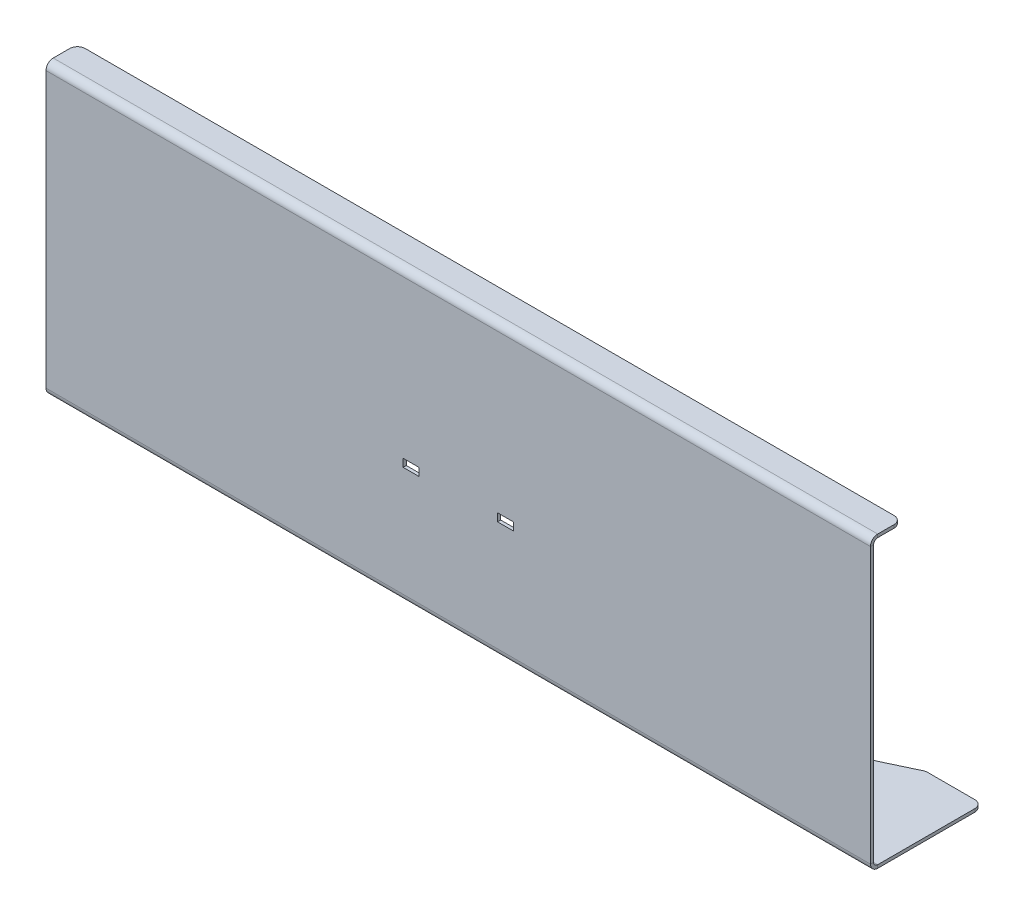
ISO-10303-21;
HEADER;
FILE_DESCRIPTION(('STEP AP214'),'2;1');
FILE_NAME('part.step','',(''),(''),'','','');
FILE_SCHEMA(('AUTOMOTIVE_DESIGN { 1 0 10303 214 1 1 1 1 }'));
ENDSEC;
DATA;
#1=APPLICATION_CONTEXT('core data for automotive mechanical design processes');
#2=APPLICATION_PROTOCOL_DEFINITION('international standard','automotive_design',2000,#1);
#3=PRODUCT_CONTEXT('',#1,'mechanical');
#4=PRODUCT('Part','Part','',(#3));
#5=PRODUCT_RELATED_PRODUCT_CATEGORY('part','',(#4));
#6=PRODUCT_DEFINITION_FORMATION('','',#4);
#7=PRODUCT_DEFINITION_CONTEXT('part definition',#1,'design');
#8=PRODUCT_DEFINITION('design','',#6,#7);
#9=PRODUCT_DEFINITION_SHAPE('','',#8);
#10=(LENGTH_UNIT() NAMED_UNIT(*) SI_UNIT(.MILLI.,.METRE.));
#11=(NAMED_UNIT(*) PLANE_ANGLE_UNIT() SI_UNIT($,.RADIAN.));
#12=(NAMED_UNIT(*) SI_UNIT($,.STERADIAN.) SOLID_ANGLE_UNIT());
#13=UNCERTAINTY_MEASURE_WITH_UNIT(LENGTH_MEASURE(1.E-05),#10,'distance_accuracy_value','');
#14=(GEOMETRIC_REPRESENTATION_CONTEXT(3) GLOBAL_UNCERTAINTY_ASSIGNED_CONTEXT((#13)) GLOBAL_UNIT_ASSIGNED_CONTEXT((#10,
#11,#12)) REPRESENTATION_CONTEXT('',''));
#15=CARTESIAN_POINT('',(0.,0.,0.));
#16=DIRECTION('',(0.,0.,1.));
#17=DIRECTION('',(1.,0.,0.));
#18=AXIS2_PLACEMENT_3D('',#15,#16,#17);
#19=CARTESIAN_POINT('',(-262.,4.6,-2.));
#20=DIRECTION('',(-1.,0.,0.));
#21=DIRECTION('',(0.,0.,1.));
#22=AXIS2_PLACEMENT_3D('',#19,#20,#21);
#23=PLANE('',#22);
#24=DIRECTION('',(0.,0.,-1.));
#25=VECTOR('',#24,1.);
#26=CARTESIAN_POINT('',(-262.,2.,0.));
#27=LINE('',#26,#25);
#28=CARTESIAN_POINT('',(-262.,2.,-4.6));
#29=VERTEX_POINT('',#28);
#30=CARTESIAN_POINT('',(-262.,2.,-66.2813416123875));
#31=VERTEX_POINT('',#30);
#32=EDGE_CURVE('E335',#29,#31,#27,.T.);
#33=ORIENTED_EDGE('',*,*,#32,.T.);
#34=DIRECTION('',(0.,-1.,0.));
#35=VECTOR('',#34,1.);
#36=CARTESIAN_POINT('',(-262.,4.6,-66.2813416123875));
#37=LINE('',#36,#35);
#38=CARTESIAN_POINT('',(-262.,0.,-66.2813416123875));
#39=VERTEX_POINT('',#38);
#40=EDGE_CURVE('E424',#31,#39,#37,.T.);
#41=ORIENTED_EDGE('',*,*,#40,.T.);
#42=DIRECTION('',(0.,0.,-1.));
#43=VECTOR('',#42,1.);
#44=CARTESIAN_POINT('',(-262.,0.,0.));
#45=LINE('',#44,#43);
#46=CARTESIAN_POINT('',(-262.,0.,-4.6));
#47=VERTEX_POINT('',#46);
#48=EDGE_CURVE('E295',#47,#39,#45,.T.);
#49=ORIENTED_EDGE('',*,*,#48,.F.);
#50=DIRECTION('',(0.,1.,0.));
#51=VECTOR('',#50,1.);
#52=CARTESIAN_POINT('',(-262.,0.,-4.6));
#53=LINE('',#52,#51);
#54=EDGE_CURVE('E400',#47,#29,#53,.T.);
#55=ORIENTED_EDGE('',*,*,#54,.T.);
#56=EDGE_LOOP('',(#33,#41,#49,#55));
#57=FACE_BOUND('',#56,.T.);
#58=ADVANCED_FACE('F36',(#57),#23,.T.);
#59=CARTESIAN_POINT('',(262.,4.6,-4.6));
#60=DIRECTION('',(1.,0.,0.));
#61=DIRECTION('',(0.,0.,-1.));
#62=AXIS2_PLACEMENT_3D('',#59,#60,#61);
#63=PLANE('',#62);
#64=DIRECTION('',(0.,0.,-1.));
#65=VECTOR('',#64,1.);
#66=CARTESIAN_POINT('',(262.,0.,0.));
#67=LINE('',#66,#65);
#68=CARTESIAN_POINT('',(262.,0.,-4.6));
#69=VERTEX_POINT('',#68);
#70=CARTESIAN_POINT('',(262.,0.,-66.2813416123875));
#71=VERTEX_POINT('',#70);
#72=EDGE_CURVE('E303',#69,#71,#67,.T.);
#73=ORIENTED_EDGE('',*,*,#72,.T.);
#74=DIRECTION('',(0.,-1.,0.));
#75=VECTOR('',#74,1.);
#76=CARTESIAN_POINT('',(262.,4.6,-66.2813416123875));
#77=LINE('',#76,#75);
#78=CARTESIAN_POINT('',(262.,2.,-66.2813416123875));
#79=VERTEX_POINT('',#78);
#80=EDGE_CURVE('E11',#71,#79,#77,.F.);
#81=ORIENTED_EDGE('',*,*,#80,.T.);
#82=DIRECTION('',(0.,0.,-1.));
#83=VECTOR('',#82,1.);
#84=CARTESIAN_POINT('',(262.,2.,0.));
#85=LINE('',#84,#83);
#86=CARTESIAN_POINT('',(262.,2.,-4.6));
#87=VERTEX_POINT('',#86);
#88=EDGE_CURVE('E306',#87,#79,#85,.T.);
#89=ORIENTED_EDGE('',*,*,#88,.F.);
#90=DIRECTION('',(0.,-1.,0.));
#91=VECTOR('',#90,1.);
#92=CARTESIAN_POINT('',(262.,2.,-4.6));
#93=LINE('',#92,#91);
#94=EDGE_CURVE('E402',#87,#69,#93,.T.);
#95=ORIENTED_EDGE('',*,*,#94,.T.);
#96=EDGE_LOOP('',(#73,#81,#89,#95));
#97=FACE_BOUND('',#96,.T.);
#98=ADVANCED_FACE('F508',(#97),#63,.T.);
#99=CARTESIAN_POINT('',(262.,4.6,0.));
#100=DIRECTION('',(1.,0.,0.));
#101=DIRECTION('',(0.,0.,-1.));
#102=AXIS2_PLACEMENT_3D('',#99,#100,#101);
#103=PLANE('',#102);
#104=DIRECTION('',(0.,0.,-1.));
#105=VECTOR('',#104,1.);
#106=CARTESIAN_POINT('',(262.,4.6,0.));
#107=LINE('',#106,#105);
#108=CARTESIAN_POINT('',(262.,4.6,0.));
#109=VERTEX_POINT('',#108);
#110=CARTESIAN_POINT('',(262.,4.6,-2.));
#111=VERTEX_POINT('',#110);
#112=EDGE_CURVE('E404',#109,#111,#107,.T.);
#113=ORIENTED_EDGE('',*,*,#112,.F.);
#114=CARTESIAN_POINT('',(262.,4.6,-4.6));
#115=DIRECTION('',(1.,0.,0.));
#116=DIRECTION('',(0.,0.,-1.));
#117=AXIS2_PLACEMENT_3D('',#114,#115,#116);
#118=CIRCLE('',#117,4.6);
#119=EDGE_CURVE('E329',#109,#69,#118,.T.);
#120=ORIENTED_EDGE('',*,*,#119,.T.);
#121=ORIENTED_EDGE('',*,*,#94,.F.);
#122=CARTESIAN_POINT('',(262.,4.6,-4.6));
#123=DIRECTION('',(1.,0.,0.));
#124=DIRECTION('',(0.,0.,-1.));
#125=AXIS2_PLACEMENT_3D('',#122,#123,#124);
#126=CIRCLE('',#125,2.6);
#127=EDGE_CURVE('E310',#111,#87,#126,.T.);
#128=ORIENTED_EDGE('',*,*,#127,.F.);
#129=EDGE_LOOP('',(#113,#120,#121,#128));
#130=FACE_BOUND('',#129,.T.);
#131=ADVANCED_FACE('F525',(#130),#103,.T.);
#132=CARTESIAN_POINT('',(262.,2.,-4.6));
#133=DIRECTION('',(1.,0.,0.));
#134=DIRECTION('',(0.,0.,-1.));
#135=AXIS2_PLACEMENT_3D('',#132,#133,#134);
#136=PLANE('',#135);
#137=DIRECTION('',(0.,-1.,0.));
#138=VECTOR('',#137,1.);
#139=CARTESIAN_POINT('',(262.,0.,0.));
#140=LINE('',#139,#138);
#141=CARTESIAN_POINT('',(262.,179.4,0.));
#142=VERTEX_POINT('',#141);
#143=EDGE_CURVE('E326',#142,#109,#140,.T.);
#144=ORIENTED_EDGE('',*,*,#143,.T.);
#145=ORIENTED_EDGE('',*,*,#112,.T.);
#146=DIRECTION('',(0.,1.,0.));
#147=VECTOR('',#146,1.);
#148=CARTESIAN_POINT('',(262.,0.,-2.));
#149=LINE('',#148,#147);
#150=CARTESIAN_POINT('',(262.,179.4,-2.));
#151=VERTEX_POINT('',#150);
#152=EDGE_CURVE('E313',#151,#111,#149,.F.);
#153=ORIENTED_EDGE('',*,*,#152,.F.);
#154=DIRECTION('',(0.,0.,1.));
#155=VECTOR('',#154,1.);
#156=CARTESIAN_POINT('',(262.,179.4,-2.));
#157=LINE('',#156,#155);
#158=EDGE_CURVE('E393',#151,#142,#157,.T.);
#159=ORIENTED_EDGE('',*,*,#158,.T.);
#160=EDGE_LOOP('',(#144,#145,#153,#159));
#161=FACE_BOUND('',#160,.T.);
#162=ADVANCED_FACE('F533',(#161),#136,.T.);
#163=CARTESIAN_POINT('',(-262.,0.,-4.6));
#164=DIRECTION('',(-1.,0.,0.));
#165=DIRECTION('',(0.,0.,1.));
#166=AXIS2_PLACEMENT_3D('',#163,#164,#165);
#167=PLANE('',#166);
#168=ORIENTED_EDGE('',*,*,#54,.F.);
#169=CARTESIAN_POINT('',(-262.,4.6,-4.6));
#170=DIRECTION('',(1.,0.,0.));
#171=DIRECTION('',(0.,0.,-1.));
#172=AXIS2_PLACEMENT_3D('',#169,#170,#171);
#173=CIRCLE('',#172,4.6);
#174=CARTESIAN_POINT('',(-262.,4.6,0.));
#175=VERTEX_POINT('',#174);
#176=EDGE_CURVE('E307',#175,#47,#173,.T.);
#177=ORIENTED_EDGE('',*,*,#176,.F.);
#178=DIRECTION('',(0.,0.,1.));
#179=VECTOR('',#178,1.);
#180=CARTESIAN_POINT('',(-262.,4.6,-2.));
#181=LINE('',#180,#179);
#182=CARTESIAN_POINT('',(-262.,4.6,-2.));
#183=VERTEX_POINT('',#182);
#184=EDGE_CURVE('E398',#183,#175,#181,.T.);
#185=ORIENTED_EDGE('',*,*,#184,.F.);
#186=CARTESIAN_POINT('',(-262.,4.6,-4.6));
#187=DIRECTION('',(1.,0.,0.));
#188=DIRECTION('',(0.,0.,-1.));
#189=AXIS2_PLACEMENT_3D('',#186,#187,#188);
#190=CIRCLE('',#189,2.6);
#191=EDGE_CURVE('E338',#183,#29,#190,.T.);
#192=ORIENTED_EDGE('',*,*,#191,.T.);
#193=EDGE_LOOP('',(#168,#177,#185,#192));
#194=FACE_BOUND('',#193,.T.);
#195=ADVANCED_FACE('F499',(#194),#167,.T.);
#196=CARTESIAN_POINT('',(262.,184.,-4.6));
#197=DIRECTION('',(1.,0.,0.));
#198=DIRECTION('',(0.,0.,-1.));
#199=AXIS2_PLACEMENT_3D('',#196,#197,#198);
#200=PLANE('',#199);
#201=DIRECTION('',(0.,-1.,0.));
#202=VECTOR('',#201,1.);
#203=CARTESIAN_POINT('',(262.,184.,-4.6));
#204=LINE('',#203,#202);
#205=CARTESIAN_POINT('',(262.,184.,-4.6));
#206=VERTEX_POINT('',#205);
#207=CARTESIAN_POINT('',(262.,182.,-4.6));
#208=VERTEX_POINT('',#207);
#209=EDGE_CURVE('E395',#206,#208,#204,.T.);
#210=ORIENTED_EDGE('',*,*,#209,.F.);
#211=CARTESIAN_POINT('',(262.,179.4,-4.6));
#212=DIRECTION('',(1.,0.,0.));
#213=DIRECTION('',(0.,0.,-1.));
#214=AXIS2_PLACEMENT_3D('',#211,#212,#213);
#215=CIRCLE('',#214,4.6);
#216=EDGE_CURVE('E323',#206,#142,#215,.T.);
#217=ORIENTED_EDGE('',*,*,#216,.T.);
#218=ORIENTED_EDGE('',*,*,#158,.F.);
#219=CARTESIAN_POINT('',(262.,179.4,-4.6));
#220=DIRECTION('',(1.,0.,0.));
#221=DIRECTION('',(0.,0.,-1.));
#222=AXIS2_PLACEMENT_3D('',#219,#220,#221);
#223=CIRCLE('',#222,2.6);
#224=EDGE_CURVE('E316',#208,#151,#223,.T.);
#225=ORIENTED_EDGE('',*,*,#224,.F.);
#226=EDGE_LOOP('',(#210,#217,#218,#225));
#227=FACE_BOUND('',#226,.T.);
#228=ADVANCED_FACE('F529',(#227),#200,.T.);
#229=CARTESIAN_POINT('',(262.,179.4,-2.));
#230=DIRECTION('',(1.,0.,0.));
#231=DIRECTION('',(0.,0.,-1.));
#232=AXIS2_PLACEMENT_3D('',#229,#230,#231);
#233=PLANE('',#232);
#234=DIRECTION('',(0.,0.,-1.));
#235=VECTOR('',#234,1.);
#236=CARTESIAN_POINT('',(262.,182.,0.));
#237=LINE('',#236,#235);
#238=CARTESIAN_POINT('',(262.,182.,-15.));
#239=VERTEX_POINT('',#238);
#240=EDGE_CURVE('E319',#239,#208,#237,.F.);
#241=ORIENTED_EDGE('',*,*,#240,.F.);
#242=DIRECTION('',(0.,-1.,0.));
#243=VECTOR('',#242,1.);
#244=CARTESIAN_POINT('',(262.,179.4,-15.));
#245=LINE('',#244,#243);
#246=CARTESIAN_POINT('',(262.,184.,-15.));
#247=VERTEX_POINT('',#246);
#248=EDGE_CURVE('E415',#239,#247,#245,.F.);
#249=ORIENTED_EDGE('',*,*,#248,.T.);
#250=DIRECTION('',(0.,0.,1.));
#251=VECTOR('',#250,1.);
#252=CARTESIAN_POINT('',(262.,184.,0.));
#253=LINE('',#252,#251);
#254=EDGE_CURVE('E321',#247,#206,#253,.T.);
#255=ORIENTED_EDGE('',*,*,#254,.T.);
#256=ORIENTED_EDGE('',*,*,#209,.T.);
#257=EDGE_LOOP('',(#241,#249,#255,#256));
#258=FACE_BOUND('',#257,.T.);
#259=ADVANCED_FACE('F808',(#258),#233,.T.);
#260=CARTESIAN_POINT('',(-262.,179.4,0.));
#261=DIRECTION('',(-1.,0.,0.));
#262=DIRECTION('',(0.,0.,1.));
#263=AXIS2_PLACEMENT_3D('',#260,#261,#262);
#264=PLANE('',#263);
#265=DIRECTION('',(0.,0.,-1.));
#266=VECTOR('',#265,1.);
#267=CARTESIAN_POINT('',(-262.,179.4,0.));
#268=LINE('',#267,#266);
#269=CARTESIAN_POINT('',(-262.,179.4,0.));
#270=VERTEX_POINT('',#269);
#271=CARTESIAN_POINT('',(-262.,179.4,-2.));
#272=VERTEX_POINT('',#271);
#273=EDGE_CURVE('E391',#270,#272,#268,.T.);
#274=ORIENTED_EDGE('',*,*,#273,.F.);
#275=CARTESIAN_POINT('',(-262.,179.4,-4.6));
#276=DIRECTION('',(1.,0.,0.));
#277=DIRECTION('',(0.,0.,-1.));
#278=AXIS2_PLACEMENT_3D('',#275,#276,#277);
#279=CIRCLE('',#278,4.6);
#280=CARTESIAN_POINT('',(-262.,184.,-4.6));
#281=VERTEX_POINT('',#280);
#282=EDGE_CURVE('E351',#281,#270,#279,.T.);
#283=ORIENTED_EDGE('',*,*,#282,.F.);
#284=DIRECTION('',(0.,1.,0.));
#285=VECTOR('',#284,1.);
#286=CARTESIAN_POINT('',(-262.,182.,-4.6));
#287=LINE('',#286,#285);
#288=CARTESIAN_POINT('',(-262.,182.,-4.6));
#289=VERTEX_POINT('',#288);
#290=EDGE_CURVE('E388',#289,#281,#287,.T.);
#291=ORIENTED_EDGE('',*,*,#290,.F.);
#292=CARTESIAN_POINT('',(-262.,179.4,-4.6));
#293=DIRECTION('',(1.,0.,0.));
#294=DIRECTION('',(0.,0.,-1.));
#295=AXIS2_PLACEMENT_3D('',#292,#293,#294);
#296=CIRCLE('',#295,2.6);
#297=EDGE_CURVE('E344',#289,#272,#296,.T.);
#298=ORIENTED_EDGE('',*,*,#297,.T.);
#299=EDGE_LOOP('',(#274,#283,#291,#298));
#300=FACE_BOUND('',#299,.T.);
#301=ADVANCED_FACE('F797',(#300),#264,.T.);
#302=CARTESIAN_POINT('',(-262.,182.,-4.6));
#303=DIRECTION('',(-1.,0.,0.));
#304=DIRECTION('',(0.,0.,1.));
#305=AXIS2_PLACEMENT_3D('',#302,#303,#304);
#306=PLANE('',#305);
#307=DIRECTION('',(0.,-1.,0.));
#308=VECTOR('',#307,1.);
#309=CARTESIAN_POINT('',(-262.,0.,0.));
#310=LINE('',#309,#308);
#311=EDGE_CURVE('E354',#270,#175,#310,.T.);
#312=ORIENTED_EDGE('',*,*,#311,.F.);
#313=ORIENTED_EDGE('',*,*,#273,.T.);
#314=DIRECTION('',(0.,1.,0.));
#315=VECTOR('',#314,1.);
#316=CARTESIAN_POINT('',(-262.,0.,-2.));
#317=LINE('',#316,#315);
#318=EDGE_CURVE('E341',#272,#183,#317,.F.);
#319=ORIENTED_EDGE('',*,*,#318,.T.);
#320=ORIENTED_EDGE('',*,*,#184,.T.);
#321=EDGE_LOOP('',(#312,#313,#319,#320));
#322=FACE_BOUND('',#321,.T.);
#323=ADVANCED_FACE('F787',(#322),#306,.T.);
#324=CARTESIAN_POINT('',(262.,0.,0.));
#325=DIRECTION('',(0.,1.,0.));
#326=DIRECTION('',(0.,0.,1.));
#327=AXIS2_PLACEMENT_3D('',#324,#325,#326);
#328=PLANE('',#327);
#329=ORIENTED_EDGE('',*,*,#48,.T.);
#330=CARTESIAN_POINT('',(-257.,0.,-66.2813416123875));
#331=DIRECTION('',(0.,1.,0.));
#332=DIRECTION('',(0.,0.,1.));
#333=AXIS2_PLACEMENT_3D('',#330,#331,#332);
#334=CIRCLE('',#333,5.);
#335=CARTESIAN_POINT('',(-257.,0.,-71.2813416123875));
#336=VERTEX_POINT('',#335);
#337=EDGE_CURVE('E433',#39,#336,#334,.F.);
#338=ORIENTED_EDGE('',*,*,#337,.T.);
#339=DIRECTION('',(1.,0.,0.));
#340=VECTOR('',#339,1.);
#341=CARTESIAN_POINT('',(-262.,0.,-71.2813416123875));
#342=LINE('',#341,#340);
#343=CARTESIAN_POINT('',(-226.953887564455,0.,-71.2813416123875));
#344=VERTEX_POINT('',#343);
#345=EDGE_CURVE('E284',#336,#344,#342,.T.);
#346=ORIENTED_EDGE('',*,*,#345,.T.);
#347=CARTESIAN_POINT('',(-226.953887564455,0.,-66.2813416123874));
#348=DIRECTION('',(0.,1.,0.));
#349=DIRECTION('',(0.,0.,1.));
#350=AXIS2_PLACEMENT_3D('',#347,#348,#349);
#351=CIRCLE('',#350,5.);
#352=CARTESIAN_POINT('',(-224.728849451078,0.,-70.7589755181483));
#353=VERTEX_POINT('',#352);
#354=EDGE_CURVE('E431',#344,#353,#351,.F.);
#355=ORIENTED_EDGE('',*,*,#354,.T.);
#356=CARTESIAN_POINT('',(0.,0.,-523.));
#357=DIRECTION('',(0.,1.,0.));
#358=DIRECTION('',(0.,0.,1.));
#359=AXIS2_PLACEMENT_3D('',#356,#357,#358);
#360=CIRCLE('',#359,505.);
#361=CARTESIAN_POINT('',(224.728849451078,0.,-70.7589755181484));
#362=VERTEX_POINT('',#361);
#363=EDGE_CURVE('E298',#353,#362,#360,.T.);
#364=ORIENTED_EDGE('',*,*,#363,.T.);
#365=CARTESIAN_POINT('',(226.953887564455,0.,-66.2813416123875));
#366=DIRECTION('',(0.,1.,0.));
#367=DIRECTION('',(0.,0.,1.));
#368=AXIS2_PLACEMENT_3D('',#365,#366,#367);
#369=CIRCLE('',#368,5.);
#370=CARTESIAN_POINT('',(226.953887564455,0.,-71.2813416123875));
#371=VERTEX_POINT('',#370);
#372=EDGE_CURVE('E429',#362,#371,#369,.F.);
#373=ORIENTED_EDGE('',*,*,#372,.T.);
#374=DIRECTION('',(1.,0.,0.));
#375=VECTOR('',#374,1.);
#376=CARTESIAN_POINT('',(262.,0.,-71.2813416123875));
#377=LINE('',#376,#375);
#378=CARTESIAN_POINT('',(257.,0.,-71.2813416123875));
#379=VERTEX_POINT('',#378);
#380=EDGE_CURVE('E289',#371,#379,#377,.T.);
#381=ORIENTED_EDGE('',*,*,#380,.T.);
#382=CARTESIAN_POINT('',(257.,0.,-66.2813416123875));
#383=DIRECTION('',(0.,1.,0.));
#384=DIRECTION('',(0.,0.,1.));
#385=AXIS2_PLACEMENT_3D('',#382,#383,#384);
#386=CIRCLE('',#385,5.);
#387=EDGE_CURVE('E427',#379,#71,#386,.F.);
#388=ORIENTED_EDGE('',*,*,#387,.T.);
#389=ORIENTED_EDGE('',*,*,#72,.F.);
#390=DIRECTION('',(-1.,0.,0.));
#391=VECTOR('',#390,1.);
#392=CARTESIAN_POINT('',(262.,0.,-4.6));
#393=LINE('',#392,#391);
#394=EDGE_CURVE('E332',#69,#47,#393,.T.);
#395=ORIENTED_EDGE('',*,*,#394,.T.);
#396=EDGE_LOOP('',(#329,#338,#346,#355,#364,#373,#381,#388,#389,#395));
#397=FACE_BOUND('',#396,.T.);
#398=ADVANCED_FACE('F475',(#397),#328,.F.);
#399=CARTESIAN_POINT('',(262.,2.,0.));
#400=DIRECTION('',(0.,1.,0.));
#401=DIRECTION('',(0.,0.,1.));
#402=AXIS2_PLACEMENT_3D('',#399,#400,#401);
#403=PLANE('',#402);
#404=DIRECTION('',(1.,0.,0.));
#405=VECTOR('',#404,1.);
#406=CARTESIAN_POINT('',(-262.,2.,-71.2813416123875));
#407=LINE('',#406,#405);
#408=CARTESIAN_POINT('',(-257.,2.,-71.2813416123875));
#409=VERTEX_POINT('',#408);
#410=CARTESIAN_POINT('',(-226.953887564455,2.,-71.2813416123875));
#411=VERTEX_POINT('',#410);
#412=EDGE_CURVE('E285',#409,#411,#407,.T.);
#413=ORIENTED_EDGE('',*,*,#412,.F.);
#414=CARTESIAN_POINT('',(-257.,2.,-66.2813416123875));
#415=DIRECTION('',(0.,1.,0.));
#416=DIRECTION('',(0.,0.,1.));
#417=AXIS2_PLACEMENT_3D('',#414,#415,#416);
#418=CIRCLE('',#417,5.);
#419=EDGE_CURVE('E446',#409,#31,#418,.T.);
#420=ORIENTED_EDGE('',*,*,#419,.T.);
#421=ORIENTED_EDGE('',*,*,#32,.F.);
#422=DIRECTION('',(-1.,0.,0.));
#423=VECTOR('',#422,1.);
#424=CARTESIAN_POINT('',(262.,2.,-4.6));
#425=LINE('',#424,#423);
#426=EDGE_CURVE('E385',#87,#29,#425,.T.);
#427=ORIENTED_EDGE('',*,*,#426,.F.);
#428=ORIENTED_EDGE('',*,*,#88,.T.);
#429=CARTESIAN_POINT('',(257.,2.,-66.2813416123875));
#430=DIRECTION('',(0.,1.,0.));
#431=DIRECTION('',(0.,0.,1.));
#432=AXIS2_PLACEMENT_3D('',#429,#430,#431);
#433=CIRCLE('',#432,5.);
#434=CARTESIAN_POINT('',(257.,2.,-71.2813416123875));
#435=VERTEX_POINT('',#434);
#436=EDGE_CURVE('E440',#79,#435,#433,.T.);
#437=ORIENTED_EDGE('',*,*,#436,.T.);
#438=DIRECTION('',(1.,0.,0.));
#439=VECTOR('',#438,1.);
#440=CARTESIAN_POINT('',(262.,2.,-71.2813416123875));
#441=LINE('',#440,#439);
#442=CARTESIAN_POINT('',(226.953887564455,2.,-71.2813416123875));
#443=VERTEX_POINT('',#442);
#444=EDGE_CURVE('E292',#443,#435,#441,.T.);
#445=ORIENTED_EDGE('',*,*,#444,.F.);
#446=CARTESIAN_POINT('',(226.953887564455,2.,-66.2813416123875));
#447=DIRECTION('',(0.,1.,0.));
#448=DIRECTION('',(0.,0.,1.));
#449=AXIS2_PLACEMENT_3D('',#446,#447,#448);
#450=CIRCLE('',#449,5.);
#451=CARTESIAN_POINT('',(224.728849451078,2.,-70.7589755181484));
#452=VERTEX_POINT('',#451);
#453=EDGE_CURVE('E442',#443,#452,#450,.T.);
#454=ORIENTED_EDGE('',*,*,#453,.T.);
#455=CARTESIAN_POINT('',(0.,2.,-523.));
#456=DIRECTION('',(0.,1.,0.));
#457=DIRECTION('',(0.,0.,1.));
#458=AXIS2_PLACEMENT_3D('',#455,#456,#457);
#459=CIRCLE('',#458,505.);
#460=CARTESIAN_POINT('',(-224.728849451078,2.,-70.7589755181483));
#461=VERTEX_POINT('',#460);
#462=EDGE_CURVE('E288',#461,#452,#459,.T.);
#463=ORIENTED_EDGE('',*,*,#462,.F.);
#464=CARTESIAN_POINT('',(-226.953887564455,2.,-66.2813416123874));
#465=DIRECTION('',(0.,1.,0.));
#466=DIRECTION('',(0.,0.,1.));
#467=AXIS2_PLACEMENT_3D('',#464,#465,#466);
#468=CIRCLE('',#467,5.);
#469=EDGE_CURVE('E444',#461,#411,#468,.T.);
#470=ORIENTED_EDGE('',*,*,#469,.T.);
#471=EDGE_LOOP('',(#413,#420,#421,#427,#428,#437,#445,#454,#463,#470));
#472=FACE_BOUND('',#471,.T.);
#473=ADVANCED_FACE('F465',(#472),#403,.T.);
#474=CARTESIAN_POINT('',(262.,4.6,-4.6));
#475=DIRECTION('',(-1.,0.,0.));
#476=DIRECTION('',(0.,0.,1.));
#477=AXIS2_PLACEMENT_3D('',#474,#475,#476);
#478=CYLINDRICAL_SURFACE('',#477,2.6);
#479=ORIENTED_EDGE('',*,*,#191,.F.);
#480=DIRECTION('',(-1.,0.,0.));
#481=VECTOR('',#480,1.);
#482=CARTESIAN_POINT('',(262.,4.6,-2.));
#483=LINE('',#482,#481);
#484=EDGE_CURVE('E382',#111,#183,#483,.T.);
#485=ORIENTED_EDGE('',*,*,#484,.F.);
#486=ORIENTED_EDGE('',*,*,#127,.T.);
#487=ORIENTED_EDGE('',*,*,#426,.T.);
#488=EDGE_LOOP('',(#479,#485,#486,#487));
#489=FACE_BOUND('',#488,.T.);
#490=ADVANCED_FACE('F503',(#489),#478,.F.);
#491=CARTESIAN_POINT('',(262.,0.,-2.));
#492=DIRECTION('',(0.,0.,-1.));
#493=DIRECTION('',(-1.,0.,0.));
#494=AXIS2_PLACEMENT_3D('',#491,#492,#493);
#495=PLANE('',#494);
#496=DIRECTION('',(0.,1.,0.));
#497=VECTOR('',#496,1.);
#498=CARTESIAN_POINT('',(-35.,0.,-2.));
#499=LINE('',#498,#497);
#500=CARTESIAN_POINT('',(-35.,74.5,-2.));
#501=VERTEX_POINT('',#500);
#502=CARTESIAN_POINT('',(-35.,79.5,-2.));
#503=VERTEX_POINT('',#502);
#504=EDGE_CURVE('E282',#501,#503,#499,.T.);
#505=ORIENTED_EDGE('',*,*,#504,.F.);
#506=DIRECTION('',(-1.,0.,0.));
#507=VECTOR('',#506,1.);
#508=CARTESIAN_POINT('',(262.,74.5,-2.));
#509=LINE('',#508,#507);
#510=CARTESIAN_POINT('',(-25.,74.5,-2.));
#511=VERTEX_POINT('',#510);
#512=EDGE_CURVE('E277',#511,#501,#509,.T.);
#513=ORIENTED_EDGE('',*,*,#512,.F.);
#514=DIRECTION('',(0.,-1.,0.));
#515=VECTOR('',#514,1.);
#516=CARTESIAN_POINT('',(-25.,0.,-2.));
#517=LINE('',#516,#515);
#518=CARTESIAN_POINT('',(-25.,79.5,-2.));
#519=VERTEX_POINT('',#518);
#520=EDGE_CURVE('E225',#519,#511,#517,.T.);
#521=ORIENTED_EDGE('',*,*,#520,.F.);
#522=DIRECTION('',(1.,0.,0.));
#523=VECTOR('',#522,1.);
#524=CARTESIAN_POINT('',(262.,79.4999999999996,-2.));
#525=LINE('',#524,#523);
#526=EDGE_CURVE('E280',#503,#519,#525,.T.);
#527=ORIENTED_EDGE('',*,*,#526,.F.);
#528=EDGE_LOOP('',(#505,#513,#521,#527));
#529=FACE_BOUND('',#528,.T.);
#530=DIRECTION('',(0.,1.,0.));
#531=VECTOR('',#530,1.);
#532=CARTESIAN_POINT('',(25.,0.,-2.));
#533=LINE('',#532,#531);
#534=CARTESIAN_POINT('',(25.,74.5,-2.));
#535=VERTEX_POINT('',#534);
#536=CARTESIAN_POINT('',(25.,79.5,-2.));
#537=VERTEX_POINT('',#536);
#538=EDGE_CURVE('E275',#535,#537,#533,.T.);
#539=ORIENTED_EDGE('',*,*,#538,.F.);
#540=DIRECTION('',(-1.,0.,0.));
#541=VECTOR('',#540,1.);
#542=CARTESIAN_POINT('',(262.,74.5,-2.));
#543=LINE('',#542,#541);
#544=CARTESIAN_POINT('',(35.,74.5,-2.));
#545=VERTEX_POINT('',#544);
#546=EDGE_CURVE('E249',#545,#535,#543,.T.);
#547=ORIENTED_EDGE('',*,*,#546,.F.);
#548=DIRECTION('',(0.,-1.,0.));
#549=VECTOR('',#548,1.);
#550=CARTESIAN_POINT('',(35.,0.,-2.));
#551=LINE('',#550,#549);
#552=CARTESIAN_POINT('',(35.,79.5,-2.));
#553=VERTEX_POINT('',#552);
#554=EDGE_CURVE('E271',#553,#545,#551,.T.);
#555=ORIENTED_EDGE('',*,*,#554,.F.);
#556=DIRECTION('',(1.,0.,0.));
#557=VECTOR('',#556,1.);
#558=CARTESIAN_POINT('',(262.,79.5,-2.));
#559=LINE('',#558,#557);
#560=EDGE_CURVE('E273',#537,#553,#559,.T.);
#561=ORIENTED_EDGE('',*,*,#560,.F.);
#562=EDGE_LOOP('',(#539,#547,#555,#561));
#563=FACE_BOUND('',#562,.T.);
#564=ORIENTED_EDGE('',*,*,#318,.F.);
#565=DIRECTION('',(-1.,0.,0.));
#566=VECTOR('',#565,1.);
#567=CARTESIAN_POINT('',(262.,179.4,-2.));
#568=LINE('',#567,#566);
#569=EDGE_CURVE('E379',#151,#272,#568,.T.);
#570=ORIENTED_EDGE('',*,*,#569,.F.);
#571=ORIENTED_EDGE('',*,*,#152,.T.);
#572=ORIENTED_EDGE('',*,*,#484,.T.);
#573=EDGE_LOOP('',(#564,#570,#571,#572));
#574=FACE_BOUND('',#573,.T.);
#575=ADVANCED_FACE('F748',(#529,#563,#574),#495,.T.);
#576=CARTESIAN_POINT('',(262.,179.4,-4.6));
#577=DIRECTION('',(-1.,0.,0.));
#578=DIRECTION('',(0.,0.,1.));
#579=AXIS2_PLACEMENT_3D('',#576,#577,#578);
#580=CYLINDRICAL_SURFACE('',#579,2.6);
#581=ORIENTED_EDGE('',*,*,#297,.F.);
#582=DIRECTION('',(-1.,0.,0.));
#583=VECTOR('',#582,1.);
#584=CARTESIAN_POINT('',(262.,182.,-4.6));
#585=LINE('',#584,#583);
#586=EDGE_CURVE('E376',#208,#289,#585,.T.);
#587=ORIENTED_EDGE('',*,*,#586,.F.);
#588=ORIENTED_EDGE('',*,*,#224,.T.);
#589=ORIENTED_EDGE('',*,*,#569,.T.);
#590=EDGE_LOOP('',(#581,#587,#588,#589));
#591=FACE_BOUND('',#590,.T.);
#592=ADVANCED_FACE('F737',(#591),#580,.F.);
#593=CARTESIAN_POINT('',(262.,182.,0.));
#594=DIRECTION('',(0.,-1.,0.));
#595=DIRECTION('',(0.,0.,-1.));
#596=AXIS2_PLACEMENT_3D('',#593,#594,#595);
#597=PLANE('',#596);
#598=DIRECTION('',(-1.,0.,0.));
#599=VECTOR('',#598,1.);
#600=CARTESIAN_POINT('',(262.,182.,-20.));
#601=LINE('',#600,#599);
#602=CARTESIAN_POINT('',(257.,182.,-20.));
#603=VERTEX_POINT('',#602);
#604=CARTESIAN_POINT('',(-257.,182.,-20.));
#605=VERTEX_POINT('',#604);
#606=EDGE_CURVE('E373',#603,#605,#601,.T.);
#607=ORIENTED_EDGE('',*,*,#606,.F.);
#608=CARTESIAN_POINT('',(257.,182.,-15.));
#609=DIRECTION('',(0.,-1.,0.));
#610=DIRECTION('',(0.,0.,-1.));
#611=AXIS2_PLACEMENT_3D('',#608,#609,#610);
#612=CIRCLE('',#611,5.);
#613=EDGE_CURVE('E413',#603,#239,#612,.T.);
#614=ORIENTED_EDGE('',*,*,#613,.T.);
#615=ORIENTED_EDGE('',*,*,#240,.T.);
#616=ORIENTED_EDGE('',*,*,#586,.T.);
#617=DIRECTION('',(0.,0.,-1.));
#618=VECTOR('',#617,1.);
#619=CARTESIAN_POINT('',(-262.,182.,0.));
#620=LINE('',#619,#618);
#621=CARTESIAN_POINT('',(-262.,182.,-15.));
#622=VERTEX_POINT('',#621);
#623=EDGE_CURVE('E347',#622,#289,#620,.F.);
#624=ORIENTED_EDGE('',*,*,#623,.F.);
#625=CARTESIAN_POINT('',(-257.,182.,-15.));
#626=DIRECTION('',(0.,-1.,0.));
#627=DIRECTION('',(0.,0.,-1.));
#628=AXIS2_PLACEMENT_3D('',#625,#626,#627);
#629=CIRCLE('',#628,5.);
#630=EDGE_CURVE('E411',#622,#605,#629,.T.);
#631=ORIENTED_EDGE('',*,*,#630,.T.);
#632=EDGE_LOOP('',(#607,#614,#615,#616,#624,#631));
#633=FACE_BOUND('',#632,.T.);
#634=ADVANCED_FACE('F726',(#633),#597,.T.);
#635=CARTESIAN_POINT('',(262.,184.,-20.));
#636=DIRECTION('',(0.,0.,-1.));
#637=DIRECTION('',(-1.,0.,0.));
#638=AXIS2_PLACEMENT_3D('',#635,#636,#637);
#639=PLANE('',#638);
#640=DIRECTION('',(-1.,0.,0.));
#641=VECTOR('',#640,1.);
#642=CARTESIAN_POINT('',(262.,184.,-20.));
#643=LINE('',#642,#641);
#644=CARTESIAN_POINT('',(257.,184.,-20.));
#645=VERTEX_POINT('',#644);
#646=CARTESIAN_POINT('',(-257.,184.,-20.));
#647=VERTEX_POINT('',#646);
#648=EDGE_CURVE('E370',#645,#647,#643,.T.);
#649=ORIENTED_EDGE('',*,*,#648,.F.);
#650=DIRECTION('',(0.,-1.,0.));
#651=VECTOR('',#650,1.);
#652=CARTESIAN_POINT('',(257.,184.,-20.));
#653=LINE('',#652,#651);
#654=EDGE_CURVE('E408',#645,#603,#653,.T.);
#655=ORIENTED_EDGE('',*,*,#654,.T.);
#656=ORIENTED_EDGE('',*,*,#606,.T.);
#657=DIRECTION('',(0.,-1.,0.));
#658=VECTOR('',#657,1.);
#659=CARTESIAN_POINT('',(-257.,184.,-20.));
#660=LINE('',#659,#658);
#661=EDGE_CURVE('E406',#605,#647,#660,.F.);
#662=ORIENTED_EDGE('',*,*,#661,.T.);
#663=EDGE_LOOP('',(#649,#655,#656,#662));
#664=FACE_BOUND('',#663,.T.);
#665=ADVANCED_FACE('F715',(#664),#639,.T.);
#666=CARTESIAN_POINT('',(262.,184.,0.));
#667=DIRECTION('',(0.,-1.,0.));
#668=DIRECTION('',(0.,0.,-1.));
#669=AXIS2_PLACEMENT_3D('',#666,#667,#668);
#670=PLANE('',#669);
#671=ORIENTED_EDGE('',*,*,#254,.F.);
#672=CARTESIAN_POINT('',(257.,184.,-15.));
#673=DIRECTION('',(0.,-1.,0.));
#674=DIRECTION('',(0.,0.,-1.));
#675=AXIS2_PLACEMENT_3D('',#672,#673,#674);
#676=CIRCLE('',#675,5.);
#677=EDGE_CURVE('E419',#247,#645,#676,.F.);
#678=ORIENTED_EDGE('',*,*,#677,.T.);
#679=ORIENTED_EDGE('',*,*,#648,.T.);
#680=CARTESIAN_POINT('',(-257.,184.,-15.));
#681=DIRECTION('',(0.,-1.,0.));
#682=DIRECTION('',(0.,0.,-1.));
#683=AXIS2_PLACEMENT_3D('',#680,#681,#682);
#684=CIRCLE('',#683,5.);
#685=CARTESIAN_POINT('',(-262.,184.,-15.));
#686=VERTEX_POINT('',#685);
#687=EDGE_CURVE('E417',#647,#686,#684,.F.);
#688=ORIENTED_EDGE('',*,*,#687,.T.);
#689=DIRECTION('',(0.,0.,1.));
#690=VECTOR('',#689,1.);
#691=CARTESIAN_POINT('',(-262.,184.,0.));
#692=LINE('',#691,#690);
#693=EDGE_CURVE('E349',#686,#281,#692,.T.);
#694=ORIENTED_EDGE('',*,*,#693,.T.);
#695=DIRECTION('',(-1.,0.,0.));
#696=VECTOR('',#695,1.);
#697=CARTESIAN_POINT('',(262.,184.,-4.6));
#698=LINE('',#697,#696);
#699=EDGE_CURVE('E367',#206,#281,#698,.T.);
#700=ORIENTED_EDGE('',*,*,#699,.F.);
#701=EDGE_LOOP('',(#671,#678,#679,#688,#694,#700));
#702=FACE_BOUND('',#701,.T.);
#703=ADVANCED_FACE('F704',(#702),#670,.F.);
#704=CARTESIAN_POINT('',(262.,179.4,-4.6));
#705=DIRECTION('',(-1.,0.,0.));
#706=DIRECTION('',(0.,0.,1.));
#707=AXIS2_PLACEMENT_3D('',#704,#705,#706);
#708=CYLINDRICAL_SURFACE('',#707,4.6);
#709=ORIENTED_EDGE('',*,*,#282,.T.);
#710=DIRECTION('',(-1.,0.,0.));
#711=VECTOR('',#710,1.);
#712=CARTESIAN_POINT('',(262.,179.4,0.));
#713=LINE('',#712,#711);
#714=EDGE_CURVE('E364',#142,#270,#713,.T.);
#715=ORIENTED_EDGE('',*,*,#714,.F.);
#716=ORIENTED_EDGE('',*,*,#216,.F.);
#717=ORIENTED_EDGE('',*,*,#699,.T.);
#718=EDGE_LOOP('',(#709,#715,#716,#717));
#719=FACE_BOUND('',#718,.T.);
#720=ADVANCED_FACE('F694',(#719),#708,.T.);
#721=CARTESIAN_POINT('',(262.,0.,0.));
#722=DIRECTION('',(0.,0.,-1.));
#723=DIRECTION('',(-1.,0.,0.));
#724=AXIS2_PLACEMENT_3D('',#721,#722,#723);
#725=PLANE('',#724);
#726=DIRECTION('',(1.,0.,0.));
#727=VECTOR('',#726,1.);
#728=CARTESIAN_POINT('',(-25.,74.5,0.));
#729=LINE('',#728,#727);
#730=CARTESIAN_POINT('',(-35.,74.5,0.));
#731=VERTEX_POINT('',#730);
#732=CARTESIAN_POINT('',(-25.,74.5,0.));
#733=VERTEX_POINT('',#732);
#734=EDGE_CURVE('E232',#731,#733,#729,.T.);
#735=ORIENTED_EDGE('',*,*,#734,.F.);
#736=DIRECTION('',(0.,-1.,0.));
#737=VECTOR('',#736,1.);
#738=CARTESIAN_POINT('',(-35.,79.5,0.));
#739=LINE('',#738,#737);
#740=CARTESIAN_POINT('',(-35.,79.5,0.));
#741=VERTEX_POINT('',#740);
#742=EDGE_CURVE('E237',#741,#731,#739,.T.);
#743=ORIENTED_EDGE('',*,*,#742,.F.);
#744=DIRECTION('',(-1.,0.,0.));
#745=VECTOR('',#744,1.);
#746=CARTESIAN_POINT('',(-25.,79.5,0.));
#747=LINE('',#746,#745);
#748=CARTESIAN_POINT('',(-25.,79.5,0.));
#749=VERTEX_POINT('',#748);
#750=EDGE_CURVE('E242',#749,#741,#747,.T.);
#751=ORIENTED_EDGE('',*,*,#750,.F.);
#752=DIRECTION('',(0.,1.,0.));
#753=VECTOR('',#752,1.);
#754=CARTESIAN_POINT('',(-25.,79.5,0.));
#755=LINE('',#754,#753);
#756=EDGE_CURVE('E222',#733,#749,#755,.T.);
#757=ORIENTED_EDGE('',*,*,#756,.F.);
#758=EDGE_LOOP('',(#735,#743,#751,#757));
#759=FACE_BOUND('',#758,.T.);
#760=DIRECTION('',(1.,0.,0.));
#761=VECTOR('',#760,1.);
#762=CARTESIAN_POINT('',(35.,74.5,0.));
#763=LINE('',#762,#761);
#764=CARTESIAN_POINT('',(25.,74.5,0.));
#765=VERTEX_POINT('',#764);
#766=CARTESIAN_POINT('',(35.,74.5,0.));
#767=VERTEX_POINT('',#766);
#768=EDGE_CURVE('E254',#765,#767,#763,.T.);
#769=ORIENTED_EDGE('',*,*,#768,.F.);
#770=DIRECTION('',(0.,-1.,0.));
#771=VECTOR('',#770,1.);
#772=CARTESIAN_POINT('',(25.,79.5,0.));
#773=LINE('',#772,#771);
#774=CARTESIAN_POINT('',(25.,79.5,0.));
#775=VERTEX_POINT('',#774);
#776=EDGE_CURVE('E252',#775,#765,#773,.T.);
#777=ORIENTED_EDGE('',*,*,#776,.F.);
#778=DIRECTION('',(-1.,0.,0.));
#779=VECTOR('',#778,1.);
#780=CARTESIAN_POINT('',(35.,79.5,0.));
#781=LINE('',#780,#779);
#782=CARTESIAN_POINT('',(35.,79.5,0.));
#783=VERTEX_POINT('',#782);
#784=EDGE_CURVE('E259',#783,#775,#781,.T.);
#785=ORIENTED_EDGE('',*,*,#784,.F.);
#786=DIRECTION('',(0.,1.,0.));
#787=VECTOR('',#786,1.);
#788=CARTESIAN_POINT('',(35.,79.5,0.));
#789=LINE('',#788,#787);
#790=EDGE_CURVE('E256',#767,#783,#789,.T.);
#791=ORIENTED_EDGE('',*,*,#790,.F.);
#792=EDGE_LOOP('',(#769,#777,#785,#791));
#793=FACE_BOUND('',#792,.T.);
#794=ORIENTED_EDGE('',*,*,#311,.T.);
#795=DIRECTION('',(-1.,0.,0.));
#796=VECTOR('',#795,1.);
#797=CARTESIAN_POINT('',(262.,4.6,0.));
#798=LINE('',#797,#796);
#799=EDGE_CURVE('E361',#109,#175,#798,.T.);
#800=ORIENTED_EDGE('',*,*,#799,.F.);
#801=ORIENTED_EDGE('',*,*,#143,.F.);
#802=ORIENTED_EDGE('',*,*,#714,.T.);
#803=EDGE_LOOP('',(#794,#800,#801,#802));
#804=FACE_BOUND('',#803,.T.);
#805=ADVANCED_FACE('F239',(#759,#793,#804),#725,.F.);
#806=CARTESIAN_POINT('',(262.,4.6,-4.6));
#807=DIRECTION('',(-1.,0.,0.));
#808=DIRECTION('',(0.,0.,1.));
#809=AXIS2_PLACEMENT_3D('',#806,#807,#808);
#810=CYLINDRICAL_SURFACE('',#809,4.6);
#811=ORIENTED_EDGE('',*,*,#176,.T.);
#812=ORIENTED_EDGE('',*,*,#394,.F.);
#813=ORIENTED_EDGE('',*,*,#119,.F.);
#814=ORIENTED_EDGE('',*,*,#799,.T.);
#815=EDGE_LOOP('',(#811,#812,#813,#814));
#816=FACE_BOUND('',#815,.T.);
#817=ADVANCED_FACE('F495',(#816),#810,.T.);
#818=CARTESIAN_POINT('',(-262.,4.6,-4.6));
#819=DIRECTION('',(1.,0.,0.));
#820=DIRECTION('',(0.,0.,-1.));
#821=AXIS2_PLACEMENT_3D('',#818,#819,#820);
#822=PLANE('',#821);
#823=ORIENTED_EDGE('',*,*,#693,.F.);
#824=DIRECTION('',(0.,-1.,0.));
#825=VECTOR('',#824,1.);
#826=CARTESIAN_POINT('',(-262.,182.,-15.));
#827=LINE('',#826,#825);
#828=EDGE_CURVE('E421',#686,#622,#827,.T.);
#829=ORIENTED_EDGE('',*,*,#828,.T.);
#830=ORIENTED_EDGE('',*,*,#623,.T.);
#831=ORIENTED_EDGE('',*,*,#290,.T.);
#832=EDGE_LOOP('',(#823,#829,#830,#831));
#833=FACE_BOUND('',#832,.T.);
#834=ADVANCED_FACE('F665',(#833),#822,.F.);
#835=CARTESIAN_POINT('',(-262.,2.,-71.2813416123875));
#836=DIRECTION('',(0.,0.,-1.));
#837=DIRECTION('',(-1.,0.,0.));
#838=AXIS2_PLACEMENT_3D('',#835,#836,#837);
#839=PLANE('',#838);
#840=ORIENTED_EDGE('',*,*,#345,.F.);
#841=DIRECTION('',(0.,-1.,0.));
#842=VECTOR('',#841,1.);
#843=CARTESIAN_POINT('',(-257.,2.,-71.2813416123875));
#844=LINE('',#843,#842);
#845=EDGE_CURVE('E438',#336,#409,#844,.F.);
#846=ORIENTED_EDGE('',*,*,#845,.T.);
#847=ORIENTED_EDGE('',*,*,#412,.T.);
#848=DIRECTION('',(0.,-1.,0.));
#849=VECTOR('',#848,1.);
#850=CARTESIAN_POINT('',(-226.953887564455,2.,-71.2813416123875));
#851=LINE('',#850,#849);
#852=EDGE_CURVE('E435',#411,#344,#851,.T.);
#853=ORIENTED_EDGE('',*,*,#852,.T.);
#854=EDGE_LOOP('',(#840,#846,#847,#853));
#855=FACE_BOUND('',#854,.T.);
#856=ADVANCED_FACE('F482',(#855),#839,.T.);
#857=CARTESIAN_POINT('',(0.,2.,-523.));
#858=DIRECTION('',(0.,-1.,0.));
#859=DIRECTION('',(0.,0.,-1.));
#860=AXIS2_PLACEMENT_3D('',#857,#858,#859);
#861=CYLINDRICAL_SURFACE('',#860,505.);
#862=ORIENTED_EDGE('',*,*,#363,.F.);
#863=DIRECTION('',(0.,-1.,0.));
#864=VECTOR('',#863,1.);
#865=CARTESIAN_POINT('',(-224.728849451078,2.,-70.7589755181483));
#866=LINE('',#865,#864);
#867=EDGE_CURVE('E451',#353,#461,#866,.F.);
#868=ORIENTED_EDGE('',*,*,#867,.T.);
#869=ORIENTED_EDGE('',*,*,#462,.T.);
#870=DIRECTION('',(0.,-1.,0.));
#871=VECTOR('',#870,1.);
#872=CARTESIAN_POINT('',(224.728849451078,2.,-70.7589755181484));
#873=LINE('',#872,#871);
#874=EDGE_CURVE('E448',#452,#362,#873,.T.);
#875=ORIENTED_EDGE('',*,*,#874,.T.);
#876=EDGE_LOOP('',(#862,#868,#869,#875));
#877=FACE_BOUND('',#876,.T.);
#878=ADVANCED_FACE('F472',(#877),#861,.F.);
#879=CARTESIAN_POINT('',(262.,2.,-71.2813416123875));
#880=DIRECTION('',(0.,0.,-1.));
#881=DIRECTION('',(-1.,0.,0.));
#882=AXIS2_PLACEMENT_3D('',#879,#880,#881);
#883=PLANE('',#882);
#884=ORIENTED_EDGE('',*,*,#380,.F.);
#885=DIRECTION('',(0.,-1.,0.));
#886=VECTOR('',#885,1.);
#887=CARTESIAN_POINT('',(226.953887564455,2.,-71.2813416123875));
#888=LINE('',#887,#886);
#889=EDGE_CURVE('E44',#371,#443,#888,.F.);
#890=ORIENTED_EDGE('',*,*,#889,.T.);
#891=ORIENTED_EDGE('',*,*,#444,.T.);
#892=DIRECTION('',(0.,-1.,0.));
#893=VECTOR('',#892,1.);
#894=CARTESIAN_POINT('',(257.,2.,-71.2813416123875));
#895=LINE('',#894,#893);
#896=EDGE_CURVE('E453',#435,#379,#895,.T.);
#897=ORIENTED_EDGE('',*,*,#896,.T.);
#898=EDGE_LOOP('',(#884,#890,#891,#897));
#899=FACE_BOUND('',#898,.T.);
#900=ADVANCED_FACE('F459',(#899),#883,.T.);
#901=CARTESIAN_POINT('',(257.,184.,-15.));
#902=DIRECTION('',(0.,-1.,0.));
#903=DIRECTION('',(0.,0.,-1.));
#904=AXIS2_PLACEMENT_3D('',#901,#902,#903);
#905=CYLINDRICAL_SURFACE('',#904,5.);
#906=ORIENTED_EDGE('',*,*,#677,.F.);
#907=ORIENTED_EDGE('',*,*,#248,.F.);
#908=ORIENTED_EDGE('',*,*,#613,.F.);
#909=ORIENTED_EDGE('',*,*,#654,.F.);
#910=EDGE_LOOP('',(#906,#907,#908,#909));
#911=FACE_BOUND('',#910,.T.);
#912=ADVANCED_FACE('F540',(#911),#905,.T.);
#913=CARTESIAN_POINT('',(-257.,4.6,-15.));
#914=DIRECTION('',(0.,1.,0.));
#915=DIRECTION('',(0.,0.,1.));
#916=AXIS2_PLACEMENT_3D('',#913,#914,#915);
#917=CYLINDRICAL_SURFACE('',#916,5.);
#918=ORIENTED_EDGE('',*,*,#687,.F.);
#919=ORIENTED_EDGE('',*,*,#661,.F.);
#920=ORIENTED_EDGE('',*,*,#630,.F.);
#921=ORIENTED_EDGE('',*,*,#828,.F.);
#922=EDGE_LOOP('',(#918,#919,#920,#921));
#923=FACE_BOUND('',#922,.T.);
#924=ADVANCED_FACE('F543',(#923),#917,.T.);
#925=CARTESIAN_POINT('',(-257.,4.6,-66.2813416123875));
#926=DIRECTION('',(0.,-1.,0.));
#927=DIRECTION('',(0.,0.,-1.));
#928=AXIS2_PLACEMENT_3D('',#925,#926,#927);
#929=CYLINDRICAL_SURFACE('',#928,5.);
#930=ORIENTED_EDGE('',*,*,#419,.F.);
#931=ORIENTED_EDGE('',*,*,#845,.F.);
#932=ORIENTED_EDGE('',*,*,#337,.F.);
#933=ORIENTED_EDGE('',*,*,#40,.F.);
#934=EDGE_LOOP('',(#930,#931,#932,#933));
#935=FACE_BOUND('',#934,.T.);
#936=ADVANCED_FACE('F488',(#935),#929,.T.);
#937=CARTESIAN_POINT('',(-226.953887564455,2.,-66.2813416123874));
#938=DIRECTION('',(0.,-1.,0.));
#939=DIRECTION('',(0.,0.,-1.));
#940=AXIS2_PLACEMENT_3D('',#937,#938,#939);
#941=CYLINDRICAL_SURFACE('',#940,5.);
#942=ORIENTED_EDGE('',*,*,#469,.F.);
#943=ORIENTED_EDGE('',*,*,#867,.F.);
#944=ORIENTED_EDGE('',*,*,#354,.F.);
#945=ORIENTED_EDGE('',*,*,#852,.F.);
#946=EDGE_LOOP('',(#942,#943,#944,#945));
#947=FACE_BOUND('',#946,.T.);
#948=ADVANCED_FACE('F480',(#947),#941,.T.);
#949=CARTESIAN_POINT('',(226.953887564455,2.,-66.2813416123875));
#950=DIRECTION('',(0.,-1.,0.));
#951=DIRECTION('',(0.,0.,-1.));
#952=AXIS2_PLACEMENT_3D('',#949,#950,#951);
#953=CYLINDRICAL_SURFACE('',#952,5.);
#954=ORIENTED_EDGE('',*,*,#453,.F.);
#955=ORIENTED_EDGE('',*,*,#889,.F.);
#956=ORIENTED_EDGE('',*,*,#372,.F.);
#957=ORIENTED_EDGE('',*,*,#874,.F.);
#958=EDGE_LOOP('',(#954,#955,#956,#957));
#959=FACE_BOUND('',#958,.T.);
#960=ADVANCED_FACE('F469',(#959),#953,.T.);
#961=CARTESIAN_POINT('',(257.,2.,-66.2813416123875));
#962=DIRECTION('',(0.,-1.,0.));
#963=DIRECTION('',(0.,0.,-1.));
#964=AXIS2_PLACEMENT_3D('',#961,#962,#963);
#965=CYLINDRICAL_SURFACE('',#964,5.);
#966=ORIENTED_EDGE('',*,*,#436,.F.);
#967=ORIENTED_EDGE('',*,*,#80,.F.);
#968=ORIENTED_EDGE('',*,*,#387,.F.);
#969=ORIENTED_EDGE('',*,*,#896,.F.);
#970=EDGE_LOOP('',(#966,#967,#968,#969));
#971=FACE_BOUND('',#970,.T.);
#972=ADVANCED_FACE('F38',(#971),#965,.T.);
#973=CARTESIAN_POINT('',(25.,79.5,-10.));
#974=DIRECTION('',(-1.,0.,0.));
#975=DIRECTION('',(0.,0.,1.));
#976=AXIS2_PLACEMENT_3D('',#973,#974,#975);
#977=PLANE('',#976);
#978=ORIENTED_EDGE('',*,*,#538,.T.);
#979=DIRECTION('',(0.,0.,1.));
#980=VECTOR('',#979,1.);
#981=CARTESIAN_POINT('',(25.,79.5,-10.));
#982=LINE('',#981,#980);
#983=EDGE_CURVE('E263',#537,#775,#982,.T.);
#984=ORIENTED_EDGE('',*,*,#983,.T.);
#985=ORIENTED_EDGE('',*,*,#776,.T.);
#986=DIRECTION('',(0.,0.,1.));
#987=VECTOR('',#986,1.);
#988=CARTESIAN_POINT('',(25.,74.5,-10.));
#989=LINE('',#988,#987);
#990=EDGE_CURVE('E262',#535,#765,#989,.T.);
#991=ORIENTED_EDGE('',*,*,#990,.F.);
#992=EDGE_LOOP('',(#978,#984,#985,#991));
#993=FACE_BOUND('',#992,.T.);
#994=ADVANCED_FACE('F512',(#993),#977,.F.);
#995=CARTESIAN_POINT('',(35.,79.5,-10.));
#996=DIRECTION('',(0.,1.,0.));
#997=DIRECTION('',(0.,0.,1.));
#998=AXIS2_PLACEMENT_3D('',#995,#996,#997);
#999=PLANE('',#998);
#1000=ORIENTED_EDGE('',*,*,#560,.T.);
#1001=DIRECTION('',(0.,0.,1.));
#1002=VECTOR('',#1001,1.);
#1003=CARTESIAN_POINT('',(35.,79.5,-10.));
#1004=LINE('',#1003,#1002);
#1005=EDGE_CURVE('E265',#553,#783,#1004,.T.);
#1006=ORIENTED_EDGE('',*,*,#1005,.T.);
#1007=ORIENTED_EDGE('',*,*,#784,.T.);
#1008=ORIENTED_EDGE('',*,*,#983,.F.);
#1009=EDGE_LOOP('',(#1000,#1006,#1007,#1008));
#1010=FACE_BOUND('',#1009,.T.);
#1011=ADVANCED_FACE('F517',(#1010),#999,.F.);
#1012=CARTESIAN_POINT('',(35.,79.5,-10.));
#1013=DIRECTION('',(1.,0.,0.));
#1014=DIRECTION('',(0.,0.,-1.));
#1015=AXIS2_PLACEMENT_3D('',#1012,#1013,#1014);
#1016=PLANE('',#1015);
#1017=ORIENTED_EDGE('',*,*,#554,.T.);
#1018=DIRECTION('',(0.,0.,1.));
#1019=VECTOR('',#1018,1.);
#1020=CARTESIAN_POINT('',(35.,74.5,-10.));
#1021=LINE('',#1020,#1019);
#1022=EDGE_CURVE('E59',#545,#767,#1021,.T.);
#1023=ORIENTED_EDGE('',*,*,#1022,.T.);
#1024=ORIENTED_EDGE('',*,*,#790,.T.);
#1025=ORIENTED_EDGE('',*,*,#1005,.F.);
#1026=EDGE_LOOP('',(#1017,#1023,#1024,#1025));
#1027=FACE_BOUND('',#1026,.T.);
#1028=ADVANCED_FACE('F581',(#1027),#1016,.F.);
#1029=CARTESIAN_POINT('',(35.,74.5,-10.));
#1030=DIRECTION('',(0.,-1.,0.));
#1031=DIRECTION('',(0.,0.,-1.));
#1032=AXIS2_PLACEMENT_3D('',#1029,#1030,#1031);
#1033=PLANE('',#1032);
#1034=ORIENTED_EDGE('',*,*,#546,.T.);
#1035=ORIENTED_EDGE('',*,*,#990,.T.);
#1036=ORIENTED_EDGE('',*,*,#768,.T.);
#1037=ORIENTED_EDGE('',*,*,#1022,.F.);
#1038=EDGE_LOOP('',(#1034,#1035,#1036,#1037));
#1039=FACE_BOUND('',#1038,.T.);
#1040=ADVANCED_FACE('F591',(#1039),#1033,.F.);
#1041=CARTESIAN_POINT('',(-35.,79.5,-10.));
#1042=DIRECTION('',(-1.,0.,0.));
#1043=DIRECTION('',(0.,0.,1.));
#1044=AXIS2_PLACEMENT_3D('',#1041,#1042,#1043);
#1045=PLANE('',#1044);
#1046=ORIENTED_EDGE('',*,*,#504,.T.);
#1047=DIRECTION('',(0.,0.,1.));
#1048=VECTOR('',#1047,1.);
#1049=CARTESIAN_POINT('',(-35.,79.5,-10.));
#1050=LINE('',#1049,#1048);
#1051=EDGE_CURVE('E247',#503,#741,#1050,.T.);
#1052=ORIENTED_EDGE('',*,*,#1051,.T.);
#1053=ORIENTED_EDGE('',*,*,#742,.T.);
#1054=DIRECTION('',(0.,0.,1.));
#1055=VECTOR('',#1054,1.);
#1056=CARTESIAN_POINT('',(-35.,74.5,-10.));
#1057=LINE('',#1056,#1055);
#1058=EDGE_CURVE('E228',#501,#731,#1057,.T.);
#1059=ORIENTED_EDGE('',*,*,#1058,.F.);
#1060=EDGE_LOOP('',(#1046,#1052,#1053,#1059));
#1061=FACE_BOUND('',#1060,.T.);
#1062=ADVANCED_FACE('F601',(#1061),#1045,.F.);
#1063=CARTESIAN_POINT('',(-25.,79.5,-10.));
#1064=DIRECTION('',(0.,1.,0.));
#1065=DIRECTION('',(-1.,0.,0.));
#1066=AXIS2_PLACEMENT_3D('',#1063,#1064,#1065);
#1067=PLANE('',#1066);
#1068=ORIENTED_EDGE('',*,*,#526,.T.);
#1069=DIRECTION('',(0.,0.,1.));
#1070=VECTOR('',#1069,1.);
#1071=CARTESIAN_POINT('',(-25.,79.5,-10.));
#1072=LINE('',#1071,#1070);
#1073=EDGE_CURVE('E227',#519,#749,#1072,.T.);
#1074=ORIENTED_EDGE('',*,*,#1073,.T.);
#1075=ORIENTED_EDGE('',*,*,#750,.T.);
#1076=ORIENTED_EDGE('',*,*,#1051,.F.);
#1077=EDGE_LOOP('',(#1068,#1074,#1075,#1076));
#1078=FACE_BOUND('',#1077,.T.);
#1079=ADVANCED_FACE('F610',(#1078),#1067,.F.);
#1080=CARTESIAN_POINT('',(-25.,79.5,-10.));
#1081=DIRECTION('',(1.,0.,0.));
#1082=DIRECTION('',(0.,0.,-1.));
#1083=AXIS2_PLACEMENT_3D('',#1080,#1081,#1082);
#1084=PLANE('',#1083);
#1085=ORIENTED_EDGE('',*,*,#520,.T.);
#1086=DIRECTION('',(0.,0.,1.));
#1087=VECTOR('',#1086,1.);
#1088=CARTESIAN_POINT('',(-25.,74.5,-10.));
#1089=LINE('',#1088,#1087);
#1090=EDGE_CURVE('E51',#511,#733,#1089,.T.);
#1091=ORIENTED_EDGE('',*,*,#1090,.T.);
#1092=ORIENTED_EDGE('',*,*,#756,.T.);
#1093=ORIENTED_EDGE('',*,*,#1073,.F.);
#1094=EDGE_LOOP('',(#1085,#1091,#1092,#1093));
#1095=FACE_BOUND('',#1094,.T.);
#1096=ADVANCED_FACE('F219',(#1095),#1084,.F.);
#1097=CARTESIAN_POINT('',(-25.,74.5,-10.));
#1098=DIRECTION('',(0.,-1.,0.));
#1099=DIRECTION('',(0.,0.,-1.));
#1100=AXIS2_PLACEMENT_3D('',#1097,#1098,#1099);
#1101=PLANE('',#1100);
#1102=ORIENTED_EDGE('',*,*,#512,.T.);
#1103=ORIENTED_EDGE('',*,*,#1058,.T.);
#1104=ORIENTED_EDGE('',*,*,#734,.T.);
#1105=ORIENTED_EDGE('',*,*,#1090,.F.);
#1106=EDGE_LOOP('',(#1102,#1103,#1104,#1105));
#1107=FACE_BOUND('',#1106,.T.);
#1108=ADVANCED_FACE('F233',(#1107),#1101,.F.);
#1109=CLOSED_SHELL('',(#58,#98,#131,#162,#195,#228,#259,#301,#323,#398,#473,#490,#575,#592,#634,
#665,#703,#720,#805,#817,#834,#856,#878,#900,#912,#924,#936,#948,#960,#972,#994,#1011,#1028,
#1040,#1062,#1079,#1096,#1108));
#1110=MANIFOLD_SOLID_BREP('B2',#1109);
#1111=ADVANCED_BREP_SHAPE_REPRESENTATION('',(#18,#1110),#14);
#1112=SHAPE_DEFINITION_REPRESENTATION(#9,#1111);
ENDSEC;
END-ISO-10303-21;
